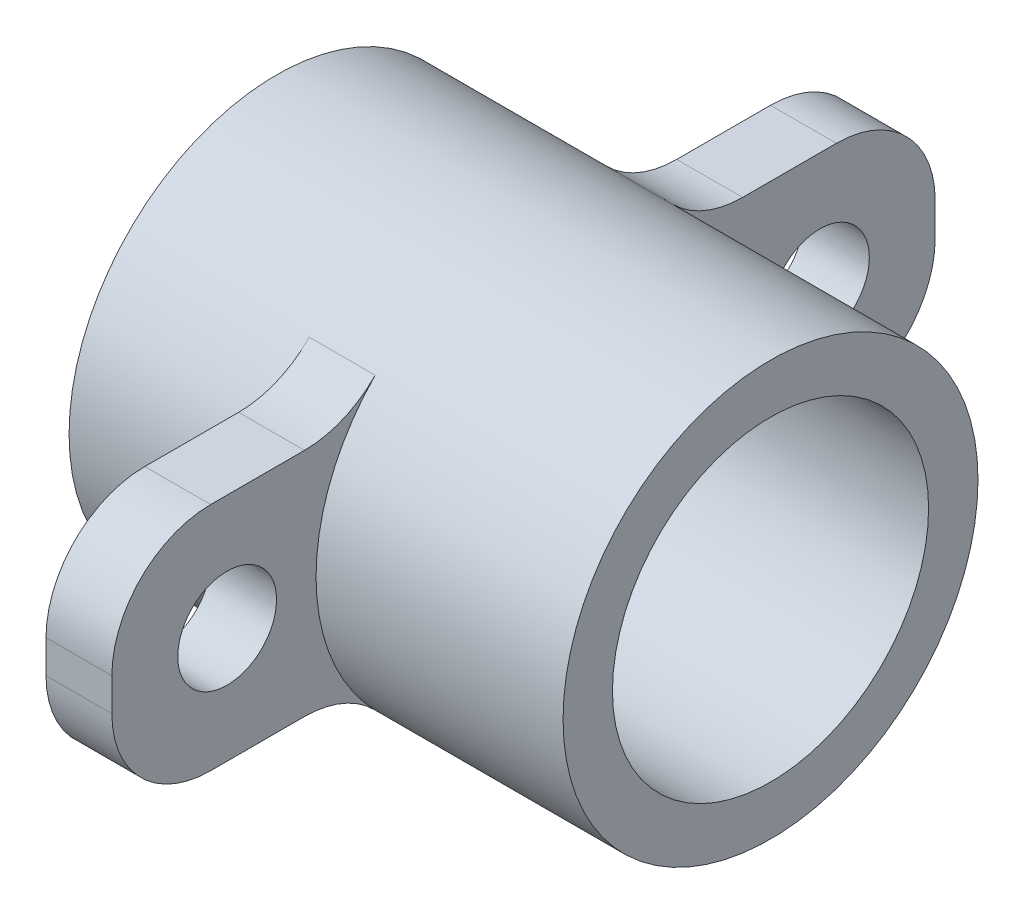
ISO-10303-21;
HEADER;
FILE_DESCRIPTION(('STEP AP214'),'2;1');
FILE_NAME('part.step','',(''),(''),'','','');
FILE_SCHEMA(('AUTOMOTIVE_DESIGN { 1 0 10303 214 1 1 1 1 }'));
ENDSEC;
DATA;
#1=APPLICATION_CONTEXT('core data for automotive mechanical design processes');
#2=APPLICATION_PROTOCOL_DEFINITION('international standard','automotive_design',2000,#1);
#3=PRODUCT_CONTEXT('',#1,'mechanical');
#4=PRODUCT('Part','Part','',(#3));
#5=PRODUCT_RELATED_PRODUCT_CATEGORY('part','',(#4));
#6=PRODUCT_DEFINITION_FORMATION('','',#4);
#7=PRODUCT_DEFINITION_CONTEXT('part definition',#1,'design');
#8=PRODUCT_DEFINITION('design','',#6,#7);
#9=PRODUCT_DEFINITION_SHAPE('','',#8);
#10=(LENGTH_UNIT() NAMED_UNIT(*) SI_UNIT(.MILLI.,.METRE.));
#11=(NAMED_UNIT(*) PLANE_ANGLE_UNIT() SI_UNIT($,.RADIAN.));
#12=(NAMED_UNIT(*) SI_UNIT($,.STERADIAN.) SOLID_ANGLE_UNIT());
#13=UNCERTAINTY_MEASURE_WITH_UNIT(LENGTH_MEASURE(1.E-05),#10,'distance_accuracy_value','');
#14=(GEOMETRIC_REPRESENTATION_CONTEXT(3) GLOBAL_UNCERTAINTY_ASSIGNED_CONTEXT((#13)) GLOBAL_UNIT_ASSIGNED_CONTEXT((#10,
#11,#12)) REPRESENTATION_CONTEXT('',''));
#15=CARTESIAN_POINT('',(0.,0.,0.));
#16=DIRECTION('',(0.,0.,1.));
#17=DIRECTION('',(1.,0.,0.));
#18=AXIS2_PLACEMENT_3D('',#15,#16,#17);
#19=CARTESIAN_POINT('',(7.5,0.,0.));
#20=DIRECTION('',(-1.,0.,0.));
#21=DIRECTION('',(0.,0.,1.));
#22=AXIS2_PLACEMENT_3D('',#19,#20,#21);
#23=CYLINDRICAL_SURFACE('',#22,6.3);
#24=DIRECTION('',(-1.,0.,0.));
#25=VECTOR('',#24,1.);
#26=CARTESIAN_POINT('',(7.5,-4.40322580645161,-4.50572996276947));
#27=LINE('',#26,#25);
#28=CARTESIAN_POINT('',(-2.,-4.40322580645161,-4.50572996276947));
#29=VERTEX_POINT('',#28);
#30=CARTESIAN_POINT('',(0.,-4.40322580645161,-4.50572996276947));
#31=VERTEX_POINT('',#30);
#32=EDGE_CURVE('E162',#29,#31,#27,.F.);
#33=ORIENTED_EDGE('',*,*,#32,.T.);
#34=CARTESIAN_POINT('',(0.,0.,0.));
#35=DIRECTION('',(-1.,0.,0.));
#36=DIRECTION('',(0.,0.,-1.));
#37=AXIS2_PLACEMENT_3D('',#34,#35,#36);
#38=CIRCLE('',#37,6.3);
#39=CARTESIAN_POINT('',(0.,4.40322580645161,-4.50572996276947));
#40=VERTEX_POINT('',#39);
#41=EDGE_CURVE('E159',#40,#31,#38,.T.);
#42=ORIENTED_EDGE('',*,*,#41,.F.);
#43=DIRECTION('',(-1.,0.,0.));
#44=VECTOR('',#43,1.);
#45=CARTESIAN_POINT('',(7.5,4.40322580645161,-4.50572996276947));
#46=LINE('',#45,#44);
#47=CARTESIAN_POINT('',(-2.,4.40322580645161,-4.50572996276947));
#48=VERTEX_POINT('',#47);
#49=EDGE_CURVE('E157',#40,#48,#46,.T.);
#50=ORIENTED_EDGE('',*,*,#49,.T.);
#51=CARTESIAN_POINT('',(-2.,0.,0.));
#52=DIRECTION('',(-1.,0.,0.));
#53=DIRECTION('',(0.,0.,-1.));
#54=AXIS2_PLACEMENT_3D('',#51,#52,#53);
#55=CIRCLE('',#54,6.3);
#56=EDGE_CURVE('E143',#48,#29,#55,.T.);
#57=ORIENTED_EDGE('',*,*,#56,.T.);
#58=EDGE_LOOP('',(#33,#42,#50,#57));
#59=FACE_BOUND('',#58,.T.);
#60=CARTESIAN_POINT('',(7.5,0.,0.));
#61=DIRECTION('',(1.,0.,0.));
#62=DIRECTION('',(0.,0.,-1.));
#63=AXIS2_PLACEMENT_3D('',#60,#61,#62);
#64=CIRCLE('',#63,6.3);
#65=CARTESIAN_POINT('',(7.5,0.,-6.3));
#66=VERTEX_POINT('',#65);
#67=EDGE_CURVE('E163',#66,#66,#64,.T.);
#68=ORIENTED_EDGE('',*,*,#67,.F.);
#69=EDGE_LOOP('',(#68));
#70=FACE_BOUND('',#69,.T.);
#71=CARTESIAN_POINT('',(-7.5,0.,0.));
#72=DIRECTION('',(1.,0.,0.));
#73=DIRECTION('',(0.,0.,-1.));
#74=AXIS2_PLACEMENT_3D('',#71,#72,#73);
#75=CIRCLE('',#74,6.3);
#76=CARTESIAN_POINT('',(-7.5,0.,-6.3));
#77=VERTEX_POINT('',#76);
#78=EDGE_CURVE('E202',#77,#77,#75,.T.);
#79=ORIENTED_EDGE('',*,*,#78,.T.);
#80=EDGE_LOOP('',(#79));
#81=FACE_BOUND('',#80,.T.);
#82=DIRECTION('',(-1.,0.,0.));
#83=VECTOR('',#82,1.);
#84=CARTESIAN_POINT('',(7.5,4.40322580645161,4.50572996276947));
#85=LINE('',#84,#83);
#86=CARTESIAN_POINT('',(-2.,4.40322580645161,4.50572996276947));
#87=VERTEX_POINT('',#86);
#88=CARTESIAN_POINT('',(0.,4.40322580645161,4.50572996276947));
#89=VERTEX_POINT('',#88);
#90=EDGE_CURVE('E210',#87,#89,#85,.F.);
#91=ORIENTED_EDGE('',*,*,#90,.T.);
#92=CARTESIAN_POINT('',(0.,0.,0.));
#93=DIRECTION('',(-1.,0.,0.));
#94=DIRECTION('',(0.,0.,-1.));
#95=AXIS2_PLACEMENT_3D('',#92,#93,#94);
#96=CIRCLE('',#95,6.3);
#97=CARTESIAN_POINT('',(0.,-4.40322580645161,4.50572996276947));
#98=VERTEX_POINT('',#97);
#99=EDGE_CURVE('E323',#98,#89,#96,.T.);
#100=ORIENTED_EDGE('',*,*,#99,.F.);
#101=DIRECTION('',(-1.,0.,0.));
#102=VECTOR('',#101,1.);
#103=CARTESIAN_POINT('',(7.5,-4.40322580645161,4.50572996276947));
#104=LINE('',#103,#102);
#105=CARTESIAN_POINT('',(-2.,-4.40322580645161,4.50572996276947));
#106=VERTEX_POINT('',#105);
#107=EDGE_CURVE('E207',#98,#106,#104,.T.);
#108=ORIENTED_EDGE('',*,*,#107,.T.);
#109=CARTESIAN_POINT('',(-2.,0.,0.));
#110=DIRECTION('',(-1.,0.,0.));
#111=DIRECTION('',(0.,0.,-1.));
#112=AXIS2_PLACEMENT_3D('',#109,#110,#111);
#113=CIRCLE('',#112,6.3);
#114=EDGE_CURVE('E334',#106,#87,#113,.T.);
#115=ORIENTED_EDGE('',*,*,#114,.T.);
#116=EDGE_LOOP('',(#91,#100,#108,#115));
#117=FACE_BOUND('',#116,.T.);
#118=ADVANCED_FACE('F33',(#59,#70,#81,#117),#23,.T.);
#119=CARTESIAN_POINT('',(7.5,0.,0.));
#120=DIRECTION('',(1.,0.,0.));
#121=DIRECTION('',(0.,0.,-1.));
#122=AXIS2_PLACEMENT_3D('',#119,#120,#121);
#123=PLANE('',#122);
#124=CARTESIAN_POINT('',(7.5,0.,0.));
#125=DIRECTION('',(-1.,0.,0.));
#126=DIRECTION('',(0.,0.,1.));
#127=AXIS2_PLACEMENT_3D('',#124,#125,#126);
#128=CIRCLE('',#127,4.8);
#129=CARTESIAN_POINT('',(7.5,0.,4.8));
#130=VERTEX_POINT('',#129);
#131=EDGE_CURVE('E344',#130,#130,#128,.T.);
#132=ORIENTED_EDGE('',*,*,#131,.T.);
#133=EDGE_LOOP('',(#132));
#134=FACE_BOUND('',#133,.T.);
#135=ORIENTED_EDGE('',*,*,#67,.T.);
#136=EDGE_LOOP('',(#135));
#137=FACE_BOUND('',#136,.T.);
#138=ADVANCED_FACE('F271',(#134,#137),#123,.T.);
#139=CARTESIAN_POINT('',(-7.5,0.,0.));
#140=DIRECTION('',(1.,0.,0.));
#141=DIRECTION('',(0.,0.,-1.));
#142=AXIS2_PLACEMENT_3D('',#139,#140,#141);
#143=PLANE('',#142);
#144=CARTESIAN_POINT('',(-7.5,0.,0.));
#145=DIRECTION('',(-1.,0.,0.));
#146=DIRECTION('',(0.,0.,1.));
#147=AXIS2_PLACEMENT_3D('',#144,#145,#146);
#148=CIRCLE('',#147,4.8);
#149=CARTESIAN_POINT('',(-7.5,0.,4.8));
#150=VERTEX_POINT('',#149);
#151=EDGE_CURVE('E347',#150,#150,#148,.T.);
#152=ORIENTED_EDGE('',*,*,#151,.F.);
#153=EDGE_LOOP('',(#152));
#154=FACE_BOUND('',#153,.T.);
#155=ORIENTED_EDGE('',*,*,#78,.F.);
#156=EDGE_LOOP('',(#155));
#157=FACE_BOUND('',#156,.T.);
#158=ADVANCED_FACE('F276',(#154,#157),#143,.F.);
#159=CARTESIAN_POINT('',(-2.,3.5,-5.23832034148352));
#160=DIRECTION('',(0.,1.,0.));
#161=DIRECTION('',(0.,0.,1.));
#162=AXIS2_PLACEMENT_3D('',#159,#160,#161);
#163=PLANE('',#162);
#164=DIRECTION('',(0.,0.,1.));
#165=VECTOR('',#164,1.);
#166=CARTESIAN_POINT('',(0.,3.5,-5.23832034148352));
#167=LINE('',#166,#165);
#168=CARTESIAN_POINT('',(0.,3.5,-9.5));
#169=VERTEX_POINT('',#168);
#170=CARTESIAN_POINT('',(0.,3.5,-6.65131565932636));
#171=VERTEX_POINT('',#170);
#172=EDGE_CURVE('E154',#169,#171,#167,.T.);
#173=ORIENTED_EDGE('',*,*,#172,.F.);
#174=DIRECTION('',(1.,0.,0.));
#175=VECTOR('',#174,1.);
#176=CARTESIAN_POINT('',(-2.,3.5,-9.5));
#177=LINE('',#176,#175);
#178=CARTESIAN_POINT('',(-2.,3.5,-9.5));
#179=VERTEX_POINT('',#178);
#180=EDGE_CURVE('E53',#169,#179,#177,.F.);
#181=ORIENTED_EDGE('',*,*,#180,.T.);
#182=DIRECTION('',(0.,0.,1.));
#183=VECTOR('',#182,1.);
#184=CARTESIAN_POINT('',(-2.,3.5,-5.23832034148352));
#185=LINE('',#184,#183);
#186=CARTESIAN_POINT('',(-2.,3.5,-6.65131565932636));
#187=VERTEX_POINT('',#186);
#188=EDGE_CURVE('E204',#179,#187,#185,.T.);
#189=ORIENTED_EDGE('',*,*,#188,.T.);
#190=DIRECTION('',(-1.,0.,0.));
#191=VECTOR('',#190,1.);
#192=CARTESIAN_POINT('',(-2.,3.5,-6.65131565932636));
#193=LINE('',#192,#191);
#194=EDGE_CURVE('E167',#187,#171,#193,.F.);
#195=ORIENTED_EDGE('',*,*,#194,.T.);
#196=EDGE_LOOP('',(#173,#181,#189,#195));
#197=FACE_BOUND('',#196,.T.);
#198=ADVANCED_FACE('F361',(#197),#163,.T.);
#199=CARTESIAN_POINT('',(-2.,3.5,-12.5));
#200=DIRECTION('',(0.,0.,-1.));
#201=DIRECTION('',(-1.,0.,0.));
#202=AXIS2_PLACEMENT_3D('',#199,#200,#201);
#203=PLANE('',#202);
#204=DIRECTION('',(0.,1.,0.));
#205=VECTOR('',#204,1.);
#206=CARTESIAN_POINT('',(0.,3.5,-12.5));
#207=LINE('',#206,#205);
#208=CARTESIAN_POINT('',(0.,-0.5,-12.5));
#209=VERTEX_POINT('',#208);
#210=CARTESIAN_POINT('',(0.,0.5,-12.5));
#211=VERTEX_POINT('',#210);
#212=EDGE_CURVE('E194',#209,#211,#207,.T.);
#213=ORIENTED_EDGE('',*,*,#212,.F.);
#214=DIRECTION('',(1.,0.,0.));
#215=VECTOR('',#214,1.);
#216=CARTESIAN_POINT('',(-2.,-0.5,-12.5));
#217=LINE('',#216,#215);
#218=CARTESIAN_POINT('',(-2.,-0.5,-12.5));
#219=VERTEX_POINT('',#218);
#220=EDGE_CURVE('E247',#209,#219,#217,.F.);
#221=ORIENTED_EDGE('',*,*,#220,.T.);
#222=DIRECTION('',(0.,1.,0.));
#223=VECTOR('',#222,1.);
#224=CARTESIAN_POINT('',(-2.,3.5,-12.5));
#225=LINE('',#224,#223);
#226=CARTESIAN_POINT('',(-2.,0.5,-12.5));
#227=VERTEX_POINT('',#226);
#228=EDGE_CURVE('E250',#219,#227,#225,.T.);
#229=ORIENTED_EDGE('',*,*,#228,.T.);
#230=DIRECTION('',(1.,0.,0.));
#231=VECTOR('',#230,1.);
#232=CARTESIAN_POINT('',(-2.,0.5,-12.5));
#233=LINE('',#232,#231);
#234=EDGE_CURVE('E244',#227,#211,#233,.T.);
#235=ORIENTED_EDGE('',*,*,#234,.T.);
#236=EDGE_LOOP('',(#213,#221,#229,#235));
#237=FACE_BOUND('',#236,.T.);
#238=ADVANCED_FACE('F256',(#237),#203,.T.);
#239=CARTESIAN_POINT('',(-2.,-3.5,-12.5));
#240=DIRECTION('',(0.,-1.,0.));
#241=DIRECTION('',(0.,0.,-1.));
#242=AXIS2_PLACEMENT_3D('',#239,#240,#241);
#243=PLANE('',#242);
#244=DIRECTION('',(0.,0.,-1.));
#245=VECTOR('',#244,1.);
#246=CARTESIAN_POINT('',(0.,-3.5,-12.5));
#247=LINE('',#246,#245);
#248=CARTESIAN_POINT('',(0.,-3.5,-6.65131565932636));
#249=VERTEX_POINT('',#248);
#250=CARTESIAN_POINT('',(0.,-3.5,-9.5));
#251=VERTEX_POINT('',#250);
#252=EDGE_CURVE('E196',#249,#251,#247,.T.);
#253=ORIENTED_EDGE('',*,*,#252,.F.);
#254=DIRECTION('',(-1.,0.,0.));
#255=VECTOR('',#254,1.);
#256=CARTESIAN_POINT('',(-2.,-3.5,-6.65131565932636));
#257=LINE('',#256,#255);
#258=CARTESIAN_POINT('',(-2.,-3.5,-6.65131565932636));
#259=VERTEX_POINT('',#258);
#260=EDGE_CURVE('E239',#249,#259,#257,.T.);
#261=ORIENTED_EDGE('',*,*,#260,.T.);
#262=DIRECTION('',(0.,0.,-1.));
#263=VECTOR('',#262,1.);
#264=CARTESIAN_POINT('',(-2.,-3.5,-12.5));
#265=LINE('',#264,#263);
#266=CARTESIAN_POINT('',(-2.,-3.5,-9.5));
#267=VERTEX_POINT('',#266);
#268=EDGE_CURVE('E153',#259,#267,#265,.T.);
#269=ORIENTED_EDGE('',*,*,#268,.T.);
#270=DIRECTION('',(1.,0.,0.));
#271=VECTOR('',#270,1.);
#272=CARTESIAN_POINT('',(-2.,-3.5,-9.5));
#273=LINE('',#272,#271);
#274=EDGE_CURVE('E236',#267,#251,#273,.T.);
#275=ORIENTED_EDGE('',*,*,#274,.T.);
#276=EDGE_LOOP('',(#253,#261,#269,#275));
#277=FACE_BOUND('',#276,.T.);
#278=ADVANCED_FACE('F305',(#277),#243,.T.);
#279=CARTESIAN_POINT('',(-2.,0.,0.));
#280=DIRECTION('',(1.,0.,0.));
#281=DIRECTION('',(0.,0.,-1.));
#282=AXIS2_PLACEMENT_3D('',#279,#280,#281);
#283=PLANE('',#282);
#284=CARTESIAN_POINT('',(-2.,0.,-9.));
#285=DIRECTION('',(1.,0.,0.));
#286=DIRECTION('',(0.,0.,-1.));
#287=AXIS2_PLACEMENT_3D('',#284,#285,#286);
#288=CIRCLE('',#287,1.5);
#289=CARTESIAN_POINT('',(-2.,0.,-10.5));
#290=VERTEX_POINT('',#289);
#291=EDGE_CURVE('E308',#290,#290,#288,.T.);
#292=ORIENTED_EDGE('',*,*,#291,.T.);
#293=EDGE_LOOP('',(#292));
#294=FACE_BOUND('',#293,.T.);
#295=ORIENTED_EDGE('',*,*,#228,.F.);
#296=CARTESIAN_POINT('',(-2.,-0.5,-9.5));
#297=DIRECTION('',(1.,0.,0.));
#298=DIRECTION('',(0.,0.,-1.));
#299=AXIS2_PLACEMENT_3D('',#296,#297,#298);
#300=CIRCLE('',#299,3.);
#301=EDGE_CURVE('E169',#219,#267,#300,.F.);
#302=ORIENTED_EDGE('',*,*,#301,.T.);
#303=ORIENTED_EDGE('',*,*,#268,.F.);
#304=CARTESIAN_POINT('',(-2.,-6.5,-6.65131565932636));
#305=DIRECTION('',(1.,0.,0.));
#306=DIRECTION('',(0.,0.,-1.));
#307=AXIS2_PLACEMENT_3D('',#304,#305,#306);
#308=CIRCLE('',#307,3.);
#309=EDGE_CURVE('E149',#259,#29,#308,.T.);
#310=ORIENTED_EDGE('',*,*,#309,.T.);
#311=ORIENTED_EDGE('',*,*,#56,.F.);
#312=CARTESIAN_POINT('',(-2.,6.5,-6.65131565932636));
#313=DIRECTION('',(1.,0.,0.));
#314=DIRECTION('',(0.,0.,-1.));
#315=AXIS2_PLACEMENT_3D('',#312,#313,#314);
#316=CIRCLE('',#315,3.);
#317=EDGE_CURVE('E11',#48,#187,#316,.T.);
#318=ORIENTED_EDGE('',*,*,#317,.T.);
#319=ORIENTED_EDGE('',*,*,#188,.F.);
#320=CARTESIAN_POINT('',(-2.,0.5,-9.5));
#321=DIRECTION('',(1.,0.,0.));
#322=DIRECTION('',(0.,0.,-1.));
#323=AXIS2_PLACEMENT_3D('',#320,#321,#322);
#324=CIRCLE('',#323,3.);
#325=EDGE_CURVE('E173',#179,#227,#324,.F.);
#326=ORIENTED_EDGE('',*,*,#325,.T.);
#327=EDGE_LOOP('',(#295,#302,#303,#310,#311,#318,#319,#326));
#328=FACE_BOUND('',#327,.T.);
#329=ADVANCED_FACE('F146',(#294,#328),#283,.F.);
#330=CARTESIAN_POINT('',(0.,0.,0.));
#331=DIRECTION('',(1.,0.,0.));
#332=DIRECTION('',(0.,0.,-1.));
#333=AXIS2_PLACEMENT_3D('',#330,#331,#332);
#334=PLANE('',#333);
#335=CARTESIAN_POINT('',(0.,0.,-9.));
#336=DIRECTION('',(1.,0.,0.));
#337=DIRECTION('',(0.,0.,-1.));
#338=AXIS2_PLACEMENT_3D('',#335,#336,#337);
#339=CIRCLE('',#338,1.5);
#340=CARTESIAN_POINT('',(0.,0.,-10.5));
#341=VERTEX_POINT('',#340);
#342=EDGE_CURVE('E313',#341,#341,#339,.T.);
#343=ORIENTED_EDGE('',*,*,#342,.F.);
#344=EDGE_LOOP('',(#343));
#345=FACE_BOUND('',#344,.T.);
#346=ORIENTED_EDGE('',*,*,#252,.T.);
#347=CARTESIAN_POINT('',(0.,-0.5,-9.5));
#348=DIRECTION('',(1.,0.,0.));
#349=DIRECTION('',(0.,0.,-1.));
#350=AXIS2_PLACEMENT_3D('',#347,#348,#349);
#351=CIRCLE('',#350,3.);
#352=EDGE_CURVE('E242',#251,#209,#351,.T.);
#353=ORIENTED_EDGE('',*,*,#352,.T.);
#354=ORIENTED_EDGE('',*,*,#212,.T.);
#355=CARTESIAN_POINT('',(0.,0.5,-9.5));
#356=DIRECTION('',(1.,0.,0.));
#357=DIRECTION('',(0.,0.,-1.));
#358=AXIS2_PLACEMENT_3D('',#355,#356,#357);
#359=CIRCLE('',#358,3.);
#360=EDGE_CURVE('E193',#211,#169,#359,.T.);
#361=ORIENTED_EDGE('',*,*,#360,.T.);
#362=ORIENTED_EDGE('',*,*,#172,.T.);
#363=CARTESIAN_POINT('',(0.,6.5,-6.65131565932636));
#364=DIRECTION('',(1.,0.,0.));
#365=DIRECTION('',(0.,0.,-1.));
#366=AXIS2_PLACEMENT_3D('',#363,#364,#365);
#367=CIRCLE('',#366,3.);
#368=EDGE_CURVE('E41',#171,#40,#367,.F.);
#369=ORIENTED_EDGE('',*,*,#368,.T.);
#370=ORIENTED_EDGE('',*,*,#41,.T.);
#371=CARTESIAN_POINT('',(0.,-6.5,-6.65131565932636));
#372=DIRECTION('',(1.,0.,0.));
#373=DIRECTION('',(0.,0.,-1.));
#374=AXIS2_PLACEMENT_3D('',#371,#372,#373);
#375=CIRCLE('',#374,3.);
#376=EDGE_CURVE('E186',#31,#249,#375,.F.);
#377=ORIENTED_EDGE('',*,*,#376,.T.);
#378=EDGE_LOOP('',(#346,#353,#354,#361,#362,#369,#370,#377));
#379=FACE_BOUND('',#378,.T.);
#380=ADVANCED_FACE('F190',(#345,#379),#334,.T.);
#381=CARTESIAN_POINT('',(-2.,0.,-9.));
#382=DIRECTION('',(1.,0.,0.));
#383=DIRECTION('',(0.,0.,-1.));
#384=AXIS2_PLACEMENT_3D('',#381,#382,#383);
#385=CYLINDRICAL_SURFACE('',#384,1.5);
#386=ORIENTED_EDGE('',*,*,#291,.F.);
#387=EDGE_LOOP('',(#386));
#388=FACE_BOUND('',#387,.T.);
#389=ORIENTED_EDGE('',*,*,#342,.T.);
#390=EDGE_LOOP('',(#389));
#391=FACE_BOUND('',#390,.T.);
#392=ADVANCED_FACE('F410',(#388,#391),#385,.F.);
#393=CARTESIAN_POINT('',(-2.,-3.5,12.5));
#394=DIRECTION('',(0.,0.,1.));
#395=DIRECTION('',(1.,0.,0.));
#396=AXIS2_PLACEMENT_3D('',#393,#394,#395);
#397=PLANE('',#396);
#398=DIRECTION('',(0.,-1.,0.));
#399=VECTOR('',#398,1.);
#400=CARTESIAN_POINT('',(0.,-3.5,12.5));
#401=LINE('',#400,#399);
#402=CARTESIAN_POINT('',(0.,0.5,12.5));
#403=VERTEX_POINT('',#402);
#404=CARTESIAN_POINT('',(0.,-0.5,12.5));
#405=VERTEX_POINT('',#404);
#406=EDGE_CURVE('E328',#403,#405,#401,.T.);
#407=ORIENTED_EDGE('',*,*,#406,.F.);
#408=DIRECTION('',(1.,0.,0.));
#409=VECTOR('',#408,1.);
#410=CARTESIAN_POINT('',(-2.,0.5,12.5));
#411=LINE('',#410,#409);
#412=CARTESIAN_POINT('',(-2.,0.5,12.5));
#413=VERTEX_POINT('',#412);
#414=EDGE_CURVE('E225',#403,#413,#411,.F.);
#415=ORIENTED_EDGE('',*,*,#414,.T.);
#416=DIRECTION('',(0.,-1.,0.));
#417=VECTOR('',#416,1.);
#418=CARTESIAN_POINT('',(-2.,-3.5,12.5));
#419=LINE('',#418,#417);
#420=CARTESIAN_POINT('',(-2.,-0.5,12.5));
#421=VERTEX_POINT('',#420);
#422=EDGE_CURVE('E322',#413,#421,#419,.T.);
#423=ORIENTED_EDGE('',*,*,#422,.T.);
#424=DIRECTION('',(1.,0.,0.));
#425=VECTOR('',#424,1.);
#426=CARTESIAN_POINT('',(-2.,-0.5,12.5));
#427=LINE('',#426,#425);
#428=EDGE_CURVE('E222',#421,#405,#427,.T.);
#429=ORIENTED_EDGE('',*,*,#428,.T.);
#430=EDGE_LOOP('',(#407,#415,#423,#429));
#431=FACE_BOUND('',#430,.T.);
#432=ADVANCED_FACE('F380',(#431),#397,.T.);
#433=CARTESIAN_POINT('',(-2.,3.5,12.5));
#434=DIRECTION('',(0.,1.,0.));
#435=DIRECTION('',(0.,0.,1.));
#436=AXIS2_PLACEMENT_3D('',#433,#434,#435);
#437=PLANE('',#436);
#438=DIRECTION('',(0.,0.,1.));
#439=VECTOR('',#438,1.);
#440=CARTESIAN_POINT('',(0.,3.5,12.5));
#441=LINE('',#440,#439);
#442=CARTESIAN_POINT('',(0.,3.5,6.65131565932636));
#443=VERTEX_POINT('',#442);
#444=CARTESIAN_POINT('',(0.,3.5,9.5));
#445=VERTEX_POINT('',#444);
#446=EDGE_CURVE('E319',#443,#445,#441,.T.);
#447=ORIENTED_EDGE('',*,*,#446,.F.);
#448=DIRECTION('',(-1.,0.,0.));
#449=VECTOR('',#448,1.);
#450=CARTESIAN_POINT('',(-2.,3.5,6.65131565932636));
#451=LINE('',#450,#449);
#452=CARTESIAN_POINT('',(-2.,3.5,6.65131565932636));
#453=VERTEX_POINT('',#452);
#454=EDGE_CURVE('E216',#443,#453,#451,.T.);
#455=ORIENTED_EDGE('',*,*,#454,.T.);
#456=DIRECTION('',(0.,0.,1.));
#457=VECTOR('',#456,1.);
#458=CARTESIAN_POINT('',(-2.,3.5,12.5));
#459=LINE('',#458,#457);
#460=CARTESIAN_POINT('',(-2.,3.5,9.5));
#461=VERTEX_POINT('',#460);
#462=EDGE_CURVE('E316',#453,#461,#459,.T.);
#463=ORIENTED_EDGE('',*,*,#462,.T.);
#464=DIRECTION('',(1.,0.,0.));
#465=VECTOR('',#464,1.);
#466=CARTESIAN_POINT('',(-2.,3.5,9.5));
#467=LINE('',#466,#465);
#468=EDGE_CURVE('E213',#461,#445,#467,.T.);
#469=ORIENTED_EDGE('',*,*,#468,.T.);
#470=EDGE_LOOP('',(#447,#455,#463,#469));
#471=FACE_BOUND('',#470,.T.);
#472=ADVANCED_FACE('F373',(#471),#437,.T.);
#473=CARTESIAN_POINT('',(-2.,-3.5,5.23832034148352));
#474=DIRECTION('',(0.,-1.,0.));
#475=DIRECTION('',(0.,0.,-1.));
#476=AXIS2_PLACEMENT_3D('',#473,#474,#475);
#477=PLANE('',#476);
#478=DIRECTION('',(0.,0.,-1.));
#479=VECTOR('',#478,1.);
#480=CARTESIAN_POINT('',(0.,-3.5,5.23832034148352));
#481=LINE('',#480,#479);
#482=CARTESIAN_POINT('',(0.,-3.5,9.5));
#483=VERTEX_POINT('',#482);
#484=CARTESIAN_POINT('',(0.,-3.5,6.65131565932636));
#485=VERTEX_POINT('',#484);
#486=EDGE_CURVE('E325',#483,#485,#481,.T.);
#487=ORIENTED_EDGE('',*,*,#486,.F.);
#488=DIRECTION('',(1.,0.,0.));
#489=VECTOR('',#488,1.);
#490=CARTESIAN_POINT('',(-2.,-3.5,9.5));
#491=LINE('',#490,#489);
#492=CARTESIAN_POINT('',(-2.,-3.5,9.5));
#493=VERTEX_POINT('',#492);
#494=EDGE_CURVE('E234',#483,#493,#491,.F.);
#495=ORIENTED_EDGE('',*,*,#494,.T.);
#496=DIRECTION('',(0.,0.,-1.));
#497=VECTOR('',#496,1.);
#498=CARTESIAN_POINT('',(-2.,-3.5,5.23832034148352));
#499=LINE('',#498,#497);
#500=CARTESIAN_POINT('',(-2.,-3.5,6.65131565932636));
#501=VERTEX_POINT('',#500);
#502=EDGE_CURVE('E336',#493,#501,#499,.T.);
#503=ORIENTED_EDGE('',*,*,#502,.T.);
#504=DIRECTION('',(-1.,0.,0.));
#505=VECTOR('',#504,1.);
#506=CARTESIAN_POINT('',(-2.,-3.5,6.65131565932636));
#507=LINE('',#506,#505);
#508=EDGE_CURVE('E231',#501,#485,#507,.F.);
#509=ORIENTED_EDGE('',*,*,#508,.T.);
#510=EDGE_LOOP('',(#487,#495,#503,#509));
#511=FACE_BOUND('',#510,.T.);
#512=ADVANCED_FACE('F387',(#511),#477,.T.);
#513=CARTESIAN_POINT('',(-2.,0.,0.));
#514=DIRECTION('',(1.,0.,0.));
#515=DIRECTION('',(0.,0.,-1.));
#516=AXIS2_PLACEMENT_3D('',#513,#514,#515);
#517=PLANE('',#516);
#518=CARTESIAN_POINT('',(-2.,0.,9.));
#519=DIRECTION('',(1.,0.,0.));
#520=DIRECTION('',(0.,0.,-1.));
#521=AXIS2_PLACEMENT_3D('',#518,#519,#520);
#522=CIRCLE('',#521,1.5);
#523=CARTESIAN_POINT('',(-2.,0.,7.5));
#524=VERTEX_POINT('',#523);
#525=EDGE_CURVE('E331',#524,#524,#522,.T.);
#526=ORIENTED_EDGE('',*,*,#525,.T.);
#527=EDGE_LOOP('',(#526));
#528=FACE_BOUND('',#527,.T.);
#529=ORIENTED_EDGE('',*,*,#422,.F.);
#530=CARTESIAN_POINT('',(-2.,0.5,9.5));
#531=DIRECTION('',(1.,0.,0.));
#532=DIRECTION('',(0.,0.,-1.));
#533=AXIS2_PLACEMENT_3D('',#530,#531,#532);
#534=CIRCLE('',#533,3.);
#535=EDGE_CURVE('E229',#413,#461,#534,.F.);
#536=ORIENTED_EDGE('',*,*,#535,.T.);
#537=ORIENTED_EDGE('',*,*,#462,.F.);
#538=CARTESIAN_POINT('',(-2.,6.5,6.65131565932636));
#539=DIRECTION('',(1.,0.,0.));
#540=DIRECTION('',(0.,0.,-1.));
#541=AXIS2_PLACEMENT_3D('',#538,#539,#540);
#542=CIRCLE('',#541,3.);
#543=EDGE_CURVE('E178',#453,#87,#542,.T.);
#544=ORIENTED_EDGE('',*,*,#543,.T.);
#545=ORIENTED_EDGE('',*,*,#114,.F.);
#546=CARTESIAN_POINT('',(-2.,-6.5,6.65131565932636));
#547=DIRECTION('',(1.,0.,0.));
#548=DIRECTION('',(0.,0.,-1.));
#549=AXIS2_PLACEMENT_3D('',#546,#547,#548);
#550=CIRCLE('',#549,3.);
#551=EDGE_CURVE('E184',#106,#501,#550,.T.);
#552=ORIENTED_EDGE('',*,*,#551,.T.);
#553=ORIENTED_EDGE('',*,*,#502,.F.);
#554=CARTESIAN_POINT('',(-2.,-0.5,9.5));
#555=DIRECTION('',(1.,0.,0.));
#556=DIRECTION('',(0.,0.,-1.));
#557=AXIS2_PLACEMENT_3D('',#554,#555,#556);
#558=CIRCLE('',#557,3.);
#559=EDGE_CURVE('E227',#493,#421,#558,.F.);
#560=ORIENTED_EDGE('',*,*,#559,.T.);
#561=EDGE_LOOP('',(#529,#536,#537,#544,#545,#552,#553,#560));
#562=FACE_BOUND('',#561,.T.);
#563=ADVANCED_FACE('F393',(#528,#562),#517,.F.);
#564=CARTESIAN_POINT('',(0.,0.,0.));
#565=DIRECTION('',(1.,0.,0.));
#566=DIRECTION('',(0.,0.,-1.));
#567=AXIS2_PLACEMENT_3D('',#564,#565,#566);
#568=PLANE('',#567);
#569=CARTESIAN_POINT('',(0.,0.,9.));
#570=DIRECTION('',(1.,0.,0.));
#571=DIRECTION('',(0.,0.,-1.));
#572=AXIS2_PLACEMENT_3D('',#569,#570,#571);
#573=CIRCLE('',#572,1.5);
#574=CARTESIAN_POINT('',(0.,0.,7.5));
#575=VERTEX_POINT('',#574);
#576=EDGE_CURVE('E341',#575,#575,#573,.T.);
#577=ORIENTED_EDGE('',*,*,#576,.F.);
#578=EDGE_LOOP('',(#577));
#579=FACE_BOUND('',#578,.T.);
#580=ORIENTED_EDGE('',*,*,#446,.T.);
#581=CARTESIAN_POINT('',(0.,0.5,9.5));
#582=DIRECTION('',(1.,0.,0.));
#583=DIRECTION('',(0.,0.,-1.));
#584=AXIS2_PLACEMENT_3D('',#581,#582,#583);
#585=CIRCLE('',#584,3.);
#586=EDGE_CURVE('E220',#445,#403,#585,.T.);
#587=ORIENTED_EDGE('',*,*,#586,.T.);
#588=ORIENTED_EDGE('',*,*,#406,.T.);
#589=CARTESIAN_POINT('',(0.,-0.5,9.5));
#590=DIRECTION('',(1.,0.,0.));
#591=DIRECTION('',(0.,0.,-1.));
#592=AXIS2_PLACEMENT_3D('',#589,#590,#591);
#593=CIRCLE('',#592,3.);
#594=EDGE_CURVE('E218',#405,#483,#593,.T.);
#595=ORIENTED_EDGE('',*,*,#594,.T.);
#596=ORIENTED_EDGE('',*,*,#486,.T.);
#597=CARTESIAN_POINT('',(0.,-6.5,6.65131565932636));
#598=DIRECTION('',(1.,0.,0.));
#599=DIRECTION('',(0.,0.,-1.));
#600=AXIS2_PLACEMENT_3D('',#597,#598,#599);
#601=CIRCLE('',#600,3.);
#602=EDGE_CURVE('E181',#485,#98,#601,.F.);
#603=ORIENTED_EDGE('',*,*,#602,.T.);
#604=ORIENTED_EDGE('',*,*,#99,.T.);
#605=CARTESIAN_POINT('',(0.,6.5,6.65131565932636));
#606=DIRECTION('',(1.,0.,0.));
#607=DIRECTION('',(0.,0.,-1.));
#608=AXIS2_PLACEMENT_3D('',#605,#606,#607);
#609=CIRCLE('',#608,3.);
#610=EDGE_CURVE('E171',#89,#443,#609,.F.);
#611=ORIENTED_EDGE('',*,*,#610,.T.);
#612=EDGE_LOOP('',(#580,#587,#588,#595,#596,#603,#604,#611));
#613=FACE_BOUND('',#612,.T.);
#614=ADVANCED_FACE('F371',(#579,#613),#568,.T.);
#615=CARTESIAN_POINT('',(-2.,0.,9.));
#616=DIRECTION('',(1.,0.,0.));
#617=DIRECTION('',(0.,0.,-1.));
#618=AXIS2_PLACEMENT_3D('',#615,#616,#617);
#619=CYLINDRICAL_SURFACE('',#618,1.5);
#620=ORIENTED_EDGE('',*,*,#525,.F.);
#621=EDGE_LOOP('',(#620));
#622=FACE_BOUND('',#621,.T.);
#623=ORIENTED_EDGE('',*,*,#576,.T.);
#624=EDGE_LOOP('',(#623));
#625=FACE_BOUND('',#624,.T.);
#626=ADVANCED_FACE('F285',(#622,#625),#619,.F.);
#627=CARTESIAN_POINT('',(7.5,6.5,6.65131565932636));
#628=DIRECTION('',(-1.,0.,0.));
#629=DIRECTION('',(0.,0.,1.));
#630=AXIS2_PLACEMENT_3D('',#627,#628,#629);
#631=CYLINDRICAL_SURFACE('',#630,3.);
#632=ORIENTED_EDGE('',*,*,#543,.F.);
#633=ORIENTED_EDGE('',*,*,#454,.F.);
#634=ORIENTED_EDGE('',*,*,#610,.F.);
#635=ORIENTED_EDGE('',*,*,#90,.F.);
#636=EDGE_LOOP('',(#632,#633,#634,#635));
#637=FACE_BOUND('',#636,.T.);
#638=ADVANCED_FACE('F281',(#637),#631,.F.);
#639=CARTESIAN_POINT('',(-2.,0.5,9.5));
#640=DIRECTION('',(1.,0.,0.));
#641=DIRECTION('',(0.,0.,-1.));
#642=AXIS2_PLACEMENT_3D('',#639,#640,#641);
#643=CYLINDRICAL_SURFACE('',#642,3.);
#644=ORIENTED_EDGE('',*,*,#535,.F.);
#645=ORIENTED_EDGE('',*,*,#414,.F.);
#646=ORIENTED_EDGE('',*,*,#586,.F.);
#647=ORIENTED_EDGE('',*,*,#468,.F.);
#648=EDGE_LOOP('',(#644,#645,#646,#647));
#649=FACE_BOUND('',#648,.T.);
#650=ADVANCED_FACE('F284',(#649),#643,.T.);
#651=CARTESIAN_POINT('',(-2.,-0.5,9.5));
#652=DIRECTION('',(1.,0.,0.));
#653=DIRECTION('',(0.,0.,-1.));
#654=AXIS2_PLACEMENT_3D('',#651,#652,#653);
#655=CYLINDRICAL_SURFACE('',#654,3.);
#656=ORIENTED_EDGE('',*,*,#559,.F.);
#657=ORIENTED_EDGE('',*,*,#494,.F.);
#658=ORIENTED_EDGE('',*,*,#594,.F.);
#659=ORIENTED_EDGE('',*,*,#428,.F.);
#660=EDGE_LOOP('',(#656,#657,#658,#659));
#661=FACE_BOUND('',#660,.T.);
#662=ADVANCED_FACE('F289',(#661),#655,.T.);
#663=CARTESIAN_POINT('',(7.5,-6.5,6.65131565932636));
#664=DIRECTION('',(-1.,0.,0.));
#665=DIRECTION('',(0.,0.,1.));
#666=AXIS2_PLACEMENT_3D('',#663,#664,#665);
#667=CYLINDRICAL_SURFACE('',#666,3.);
#668=ORIENTED_EDGE('',*,*,#551,.F.);
#669=ORIENTED_EDGE('',*,*,#107,.F.);
#670=ORIENTED_EDGE('',*,*,#602,.F.);
#671=ORIENTED_EDGE('',*,*,#508,.F.);
#672=EDGE_LOOP('',(#668,#669,#670,#671));
#673=FACE_BOUND('',#672,.T.);
#674=ADVANCED_FACE('F293',(#673),#667,.F.);
#675=CARTESIAN_POINT('',(7.5,-6.5,-6.65131565932636));
#676=DIRECTION('',(-1.,0.,0.));
#677=DIRECTION('',(0.,0.,1.));
#678=AXIS2_PLACEMENT_3D('',#675,#676,#677);
#679=CYLINDRICAL_SURFACE('',#678,3.);
#680=ORIENTED_EDGE('',*,*,#309,.F.);
#681=ORIENTED_EDGE('',*,*,#260,.F.);
#682=ORIENTED_EDGE('',*,*,#376,.F.);
#683=ORIENTED_EDGE('',*,*,#32,.F.);
#684=EDGE_LOOP('',(#680,#681,#682,#683));
#685=FACE_BOUND('',#684,.T.);
#686=ADVANCED_FACE('F267',(#685),#679,.F.);
#687=CARTESIAN_POINT('',(-2.,-0.5,-9.5));
#688=DIRECTION('',(1.,0.,0.));
#689=DIRECTION('',(0.,0.,-1.));
#690=AXIS2_PLACEMENT_3D('',#687,#688,#689);
#691=CYLINDRICAL_SURFACE('',#690,3.);
#692=ORIENTED_EDGE('',*,*,#301,.F.);
#693=ORIENTED_EDGE('',*,*,#220,.F.);
#694=ORIENTED_EDGE('',*,*,#352,.F.);
#695=ORIENTED_EDGE('',*,*,#274,.F.);
#696=EDGE_LOOP('',(#692,#693,#694,#695));
#697=FACE_BOUND('',#696,.T.);
#698=ADVANCED_FACE('F261',(#697),#691,.T.);
#699=CARTESIAN_POINT('',(-2.,0.5,-9.5));
#700=DIRECTION('',(1.,0.,0.));
#701=DIRECTION('',(0.,0.,-1.));
#702=AXIS2_PLACEMENT_3D('',#699,#700,#701);
#703=CYLINDRICAL_SURFACE('',#702,3.);
#704=ORIENTED_EDGE('',*,*,#325,.F.);
#705=ORIENTED_EDGE('',*,*,#180,.F.);
#706=ORIENTED_EDGE('',*,*,#360,.F.);
#707=ORIENTED_EDGE('',*,*,#234,.F.);
#708=EDGE_LOOP('',(#704,#705,#706,#707));
#709=FACE_BOUND('',#708,.T.);
#710=ADVANCED_FACE('F259',(#709),#703,.T.);
#711=CARTESIAN_POINT('',(7.5,6.5,-6.65131565932636));
#712=DIRECTION('',(-1.,0.,0.));
#713=DIRECTION('',(0.,0.,1.));
#714=AXIS2_PLACEMENT_3D('',#711,#712,#713);
#715=CYLINDRICAL_SURFACE('',#714,3.);
#716=ORIENTED_EDGE('',*,*,#317,.F.);
#717=ORIENTED_EDGE('',*,*,#49,.F.);
#718=ORIENTED_EDGE('',*,*,#368,.F.);
#719=ORIENTED_EDGE('',*,*,#194,.F.);
#720=EDGE_LOOP('',(#716,#717,#718,#719));
#721=FACE_BOUND('',#720,.T.);
#722=ADVANCED_FACE('F35',(#721),#715,.F.);
#723=CARTESIAN_POINT('',(7.5,0.,0.));
#724=DIRECTION('',(-1.,0.,0.));
#725=DIRECTION('',(0.,0.,1.));
#726=AXIS2_PLACEMENT_3D('',#723,#724,#725);
#727=CYLINDRICAL_SURFACE('',#726,4.8);
#728=ORIENTED_EDGE('',*,*,#131,.F.);
#729=EDGE_LOOP('',(#728));
#730=FACE_BOUND('',#729,.T.);
#731=ORIENTED_EDGE('',*,*,#151,.T.);
#732=EDGE_LOOP('',(#731));
#733=FACE_BOUND('',#732,.T.);
#734=ADVANCED_FACE('F266',(#730,#733),#727,.F.);
#735=CLOSED_SHELL('',(#118,#138,#158,#198,#238,#278,#329,#380,#392,#432,#472,#512,#563,#614,
#626,#638,#650,#662,#674,#686,#698,#710,#722,#734));
#736=MANIFOLD_SOLID_BREP('B2',#735);
#737=ADVANCED_BREP_SHAPE_REPRESENTATION('',(#18,#736),#14);
#738=SHAPE_DEFINITION_REPRESENTATION(#9,#737);
ENDSEC;
END-ISO-10303-21;
